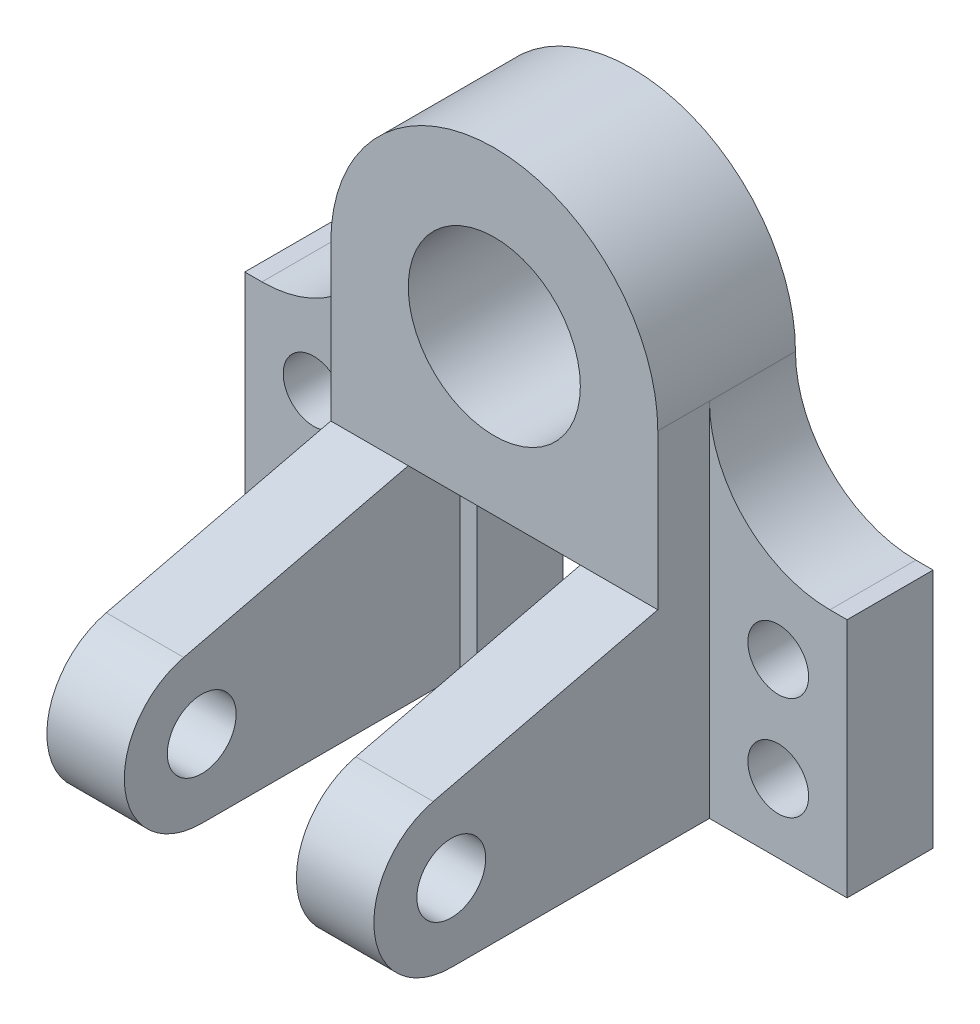
ISO-10303-21;
HEADER;
FILE_DESCRIPTION(('STEP AP214'),'2;1');
FILE_NAME('part.step','',(''),(''),'','','');
FILE_SCHEMA(('AUTOMOTIVE_DESIGN { 1 0 10303 214 1 1 1 1 }'));
ENDSEC;
DATA;
#1=APPLICATION_CONTEXT('core data for automotive mechanical design processes');
#2=APPLICATION_PROTOCOL_DEFINITION('international standard','automotive_design',2000,#1);
#3=PRODUCT_CONTEXT('',#1,'mechanical');
#4=PRODUCT('Part','Part','',(#3));
#5=PRODUCT_RELATED_PRODUCT_CATEGORY('part','',(#4));
#6=PRODUCT_DEFINITION_FORMATION('','',#4);
#7=PRODUCT_DEFINITION_CONTEXT('part definition',#1,'design');
#8=PRODUCT_DEFINITION('design','',#6,#7);
#9=PRODUCT_DEFINITION_SHAPE('','',#8);
#10=(LENGTH_UNIT() NAMED_UNIT(*) SI_UNIT(.MILLI.,.METRE.));
#11=(NAMED_UNIT(*) PLANE_ANGLE_UNIT() SI_UNIT($,.RADIAN.));
#12=(NAMED_UNIT(*) SI_UNIT($,.STERADIAN.) SOLID_ANGLE_UNIT());
#13=UNCERTAINTY_MEASURE_WITH_UNIT(LENGTH_MEASURE(1.E-05),#10,'distance_accuracy_value','');
#14=(GEOMETRIC_REPRESENTATION_CONTEXT(3) GLOBAL_UNCERTAINTY_ASSIGNED_CONTEXT((#13)) GLOBAL_UNIT_ASSIGNED_CONTEXT((#10,
#11,#12)) REPRESENTATION_CONTEXT('',''));
#15=CARTESIAN_POINT('',(0.,0.,0.));
#16=DIRECTION('',(0.,0.,1.));
#17=DIRECTION('',(1.,0.,0.));
#18=AXIS2_PLACEMENT_3D('',#15,#16,#17);
#19=CARTESIAN_POINT('',(1080.,480.,320.));
#20=DIRECTION('',(0.,1.,0.));
#21=DIRECTION('',(-1.,0.,0.));
#22=AXIS2_PLACEMENT_3D('',#19,#20,#21);
#23=PLANE('',#22);
#24=DIRECTION('',(0.,0.,-1.));
#25=VECTOR('',#24,1.);
#26=CARTESIAN_POINT('',(500.,480.,320.));
#27=LINE('',#26,#25);
#28=CARTESIAN_POINT('',(500.,480.,320.));
#29=VERTEX_POINT('',#28);
#30=CARTESIAN_POINT('',(500.,480.,200.));
#31=VERTEX_POINT('',#30);
#32=EDGE_CURVE('E187',#29,#31,#27,.T.);
#33=ORIENTED_EDGE('',*,*,#32,.T.);
#34=DIRECTION('',(-1.,0.,0.));
#35=VECTOR('',#34,1.);
#36=CARTESIAN_POINT('',(320.,480.,200.));
#37=LINE('',#36,#35);
#38=CARTESIAN_POINT('',(540.,480.,200.));
#39=VERTEX_POINT('',#38);
#40=EDGE_CURVE('E197',#39,#31,#37,.T.);
#41=ORIENTED_EDGE('',*,*,#40,.F.);
#42=DIRECTION('',(0.,0.,-1.));
#43=VECTOR('',#42,1.);
#44=CARTESIAN_POINT('',(540.,480.,200.));
#45=LINE('',#44,#43);
#46=CARTESIAN_POINT('',(540.,480.,0.));
#47=VERTEX_POINT('',#46);
#48=EDGE_CURVE('E237',#39,#47,#45,.T.);
#49=ORIENTED_EDGE('',*,*,#48,.T.);
#50=DIRECTION('',(1.,0.,0.));
#51=VECTOR('',#50,1.);
#52=CARTESIAN_POINT('',(1080.,480.,0.));
#53=LINE('',#52,#51);
#54=CARTESIAN_POINT('',(860.,480.,0.));
#55=VERTEX_POINT('',#54);
#56=EDGE_CURVE('E280',#47,#55,#53,.T.);
#57=ORIENTED_EDGE('',*,*,#56,.T.);
#58=DIRECTION('',(0.,0.,-1.));
#59=VECTOR('',#58,1.);
#60=CARTESIAN_POINT('',(860.,480.,200.));
#61=LINE('',#60,#59);
#62=CARTESIAN_POINT('',(860.,480.,200.));
#63=VERTEX_POINT('',#62);
#64=EDGE_CURVE('E316',#63,#55,#61,.T.);
#65=ORIENTED_EDGE('',*,*,#64,.F.);
#66=DIRECTION('',(-1.,0.,0.));
#67=VECTOR('',#66,1.);
#68=CARTESIAN_POINT('',(1080.,480.,200.));
#69=LINE('',#68,#67);
#70=CARTESIAN_POINT('',(900.,480.,200.));
#71=VERTEX_POINT('',#70);
#72=EDGE_CURVE('E324',#71,#63,#69,.T.);
#73=ORIENTED_EDGE('',*,*,#72,.F.);
#74=DIRECTION('',(0.,0.,1.));
#75=VECTOR('',#74,1.);
#76=CARTESIAN_POINT('',(900.,480.,320.));
#77=LINE('',#76,#75);
#78=CARTESIAN_POINT('',(900.,480.,320.));
#79=VERTEX_POINT('',#78);
#80=EDGE_CURVE('E384',#71,#79,#77,.T.);
#81=ORIENTED_EDGE('',*,*,#80,.T.);
#82=DIRECTION('',(1.,0.,0.));
#83=VECTOR('',#82,1.);
#84=CARTESIAN_POINT('',(540.,480.,320.));
#85=LINE('',#84,#83);
#86=EDGE_CURVE('E200',#29,#79,#85,.T.);
#87=ORIENTED_EDGE('',*,*,#86,.F.);
#88=EDGE_LOOP('',(#33,#41,#49,#57,#65,#73,#81,#87));
#89=FACE_BOUND('',#88,.T.);
#90=ADVANCED_FACE('F33',(#89),#23,.F.);
#91=CARTESIAN_POINT('',(0.,0.,200.));
#92=DIRECTION('',(0.,0.,-1.));
#93=DIRECTION('',(-1.,0.,0.));
#94=AXIS2_PLACEMENT_3D('',#91,#92,#93);
#95=PLANE('',#94);
#96=DIRECTION('',(0.,-1.,0.));
#97=VECTOR('',#96,1.);
#98=CARTESIAN_POINT('',(500.,480.,200.));
#99=LINE('',#98,#97);
#100=CARTESIAN_POINT('',(500.,0.,200.));
#101=VERTEX_POINT('',#100);
#102=EDGE_CURVE('E183',#31,#101,#99,.T.);
#103=ORIENTED_EDGE('',*,*,#102,.T.);
#104=DIRECTION('',(1.,0.,0.));
#105=VECTOR('',#104,1.);
#106=CARTESIAN_POINT('',(540.,0.,200.));
#107=LINE('',#106,#105);
#108=CARTESIAN_POINT('',(540.,0.,200.));
#109=VERTEX_POINT('',#108);
#110=EDGE_CURVE('E231',#101,#109,#107,.T.);
#111=ORIENTED_EDGE('',*,*,#110,.T.);
#112=DIRECTION('',(0.,1.,0.));
#113=VECTOR('',#112,1.);
#114=CARTESIAN_POINT('',(540.,480.,200.));
#115=LINE('',#114,#113);
#116=EDGE_CURVE('E206',#109,#39,#115,.T.);
#117=ORIENTED_EDGE('',*,*,#116,.T.);
#118=ORIENTED_EDGE('',*,*,#40,.T.);
#119=EDGE_LOOP('',(#103,#111,#117,#118));
#120=FACE_BOUND('',#119,.T.);
#121=ADVANCED_FACE('F204',(#120),#95,.F.);
#122=CARTESIAN_POINT('',(0.,0.,200.));
#123=DIRECTION('',(0.,0.,1.));
#124=DIRECTION('',(1.,0.,0.));
#125=AXIS2_PLACEMENT_3D('',#122,#123,#124);
#126=PLANE('',#125);
#127=DIRECTION('',(1.,0.,0.));
#128=VECTOR('',#127,1.);
#129=CARTESIAN_POINT('',(860.,0.,200.));
#130=LINE('',#129,#128);
#131=CARTESIAN_POINT('',(860.,0.,200.));
#132=VERTEX_POINT('',#131);
#133=CARTESIAN_POINT('',(900.,0.,200.));
#134=VERTEX_POINT('',#133);
#135=EDGE_CURVE('E423',#132,#134,#130,.T.);
#136=ORIENTED_EDGE('',*,*,#135,.T.);
#137=DIRECTION('',(0.,1.,0.));
#138=VECTOR('',#137,1.);
#139=CARTESIAN_POINT('',(900.,1.71450551880629E-13,200.));
#140=LINE('',#139,#138);
#141=EDGE_CURVE('E382',#134,#71,#140,.T.);
#142=ORIENTED_EDGE('',*,*,#141,.T.);
#143=ORIENTED_EDGE('',*,*,#72,.T.);
#144=DIRECTION('',(0.,-1.,0.));
#145=VECTOR('',#144,1.);
#146=CARTESIAN_POINT('',(860.,480.,200.));
#147=LINE('',#146,#145);
#148=EDGE_CURVE('E322',#63,#132,#147,.T.);
#149=ORIENTED_EDGE('',*,*,#148,.T.);
#150=EDGE_LOOP('',(#136,#142,#143,#149));
#151=FACE_BOUND('',#150,.T.);
#152=ADVANCED_FACE('F470',(#151),#126,.T.);
#153=CARTESIAN_POINT('',(0.,0.,200.));
#154=VERTEX_POINT('',#153);
#155=CARTESIAN_POINT('',(320.,0.,200.));
#156=VERTEX_POINT('',#155);
#157=EDGE_CURVE('E212',#154,#156,#107,.T.);
#158=ORIENTED_EDGE('',*,*,#157,.T.);
#159=DIRECTION('',(0.,1.,0.));
#160=VECTOR('',#159,1.);
#161=CARTESIAN_POINT('',(320.,560.,200.));
#162=LINE('',#161,#160);
#163=CARTESIAN_POINT('',(320.,840.,200.));
#164=VERTEX_POINT('',#163);
#165=EDGE_CURVE('E208',#156,#164,#162,.T.);
#166=ORIENTED_EDGE('',*,*,#165,.T.);
#167=CARTESIAN_POINT('',(40.,840.,200.));
#168=DIRECTION('',(0.,0.,-1.));
#169=DIRECTION('',(-1.,0.,0.));
#170=AXIS2_PLACEMENT_3D('',#167,#168,#169);
#171=CIRCLE('',#170,280.);
#172=CARTESIAN_POINT('',(40.,560.,200.));
#173=VERTEX_POINT('',#172);
#174=EDGE_CURVE('E247',#164,#173,#171,.T.);
#175=ORIENTED_EDGE('',*,*,#174,.T.);
#176=DIRECTION('',(-1.,0.,0.));
#177=VECTOR('',#176,1.);
#178=CARTESIAN_POINT('',(0.,560.,200.));
#179=LINE('',#178,#177);
#180=CARTESIAN_POINT('',(0.,560.,200.));
#181=VERTEX_POINT('',#180);
#182=EDGE_CURVE('E210',#173,#181,#179,.T.);
#183=ORIENTED_EDGE('',*,*,#182,.T.);
#184=DIRECTION('',(0.,-1.,0.));
#185=VECTOR('',#184,1.);
#186=CARTESIAN_POINT('',(0.,0.,200.));
#187=LINE('',#186,#185);
#188=EDGE_CURVE('E217',#181,#154,#187,.T.);
#189=ORIENTED_EDGE('',*,*,#188,.T.);
#190=EDGE_LOOP('',(#158,#166,#175,#183,#189));
#191=FACE_BOUND('',#190,.T.);
#192=CARTESIAN_POINT('',(160.,400.,200.));
#193=DIRECTION('',(0.,0.,1.));
#194=DIRECTION('',(1.,0.,0.));
#195=AXIS2_PLACEMENT_3D('',#192,#193,#194);
#196=CIRCLE('',#195,70.5953616406225);
#197=CARTESIAN_POINT('',(230.595361640622,400.,200.));
#198=VERTEX_POINT('',#197);
#199=EDGE_CURVE('E224',#198,#198,#196,.T.);
#200=ORIENTED_EDGE('',*,*,#199,.F.);
#201=EDGE_LOOP('',(#200));
#202=FACE_BOUND('',#201,.T.);
#203=CARTESIAN_POINT('',(160.,160.,200.));
#204=DIRECTION('',(0.,0.,1.));
#205=DIRECTION('',(1.,0.,0.));
#206=AXIS2_PLACEMENT_3D('',#203,#204,#205);
#207=CIRCLE('',#206,70.5953616406225);
#208=CARTESIAN_POINT('',(230.595361640622,160.,200.));
#209=VERTEX_POINT('',#208);
#210=EDGE_CURVE('E293',#209,#209,#207,.T.);
#211=ORIENTED_EDGE('',*,*,#210,.F.);
#212=EDGE_LOOP('',(#211));
#213=FACE_BOUND('',#212,.T.);
#214=ADVANCED_FACE('F253',(#191,#202,#213),#95,.F.);
#215=CARTESIAN_POINT('',(0.,0.,0.));
#216=DIRECTION('',(0.,0.,-1.));
#217=DIRECTION('',(-1.,0.,0.));
#218=AXIS2_PLACEMENT_3D('',#215,#216,#217);
#219=PLANE('',#218);
#220=DIRECTION('',(0.,-1.,0.));
#221=VECTOR('',#220,1.);
#222=CARTESIAN_POINT('',(860.,480.,0.));
#223=LINE('',#222,#221);
#224=CARTESIAN_POINT('',(860.,0.,0.));
#225=VERTEX_POINT('',#224);
#226=EDGE_CURVE('E312',#55,#225,#223,.T.);
#227=ORIENTED_EDGE('',*,*,#226,.F.);
#228=ORIENTED_EDGE('',*,*,#56,.F.);
#229=DIRECTION('',(0.,1.,0.));
#230=VECTOR('',#229,1.);
#231=CARTESIAN_POINT('',(540.,480.,0.));
#232=LINE('',#231,#230);
#233=CARTESIAN_POINT('',(540.,0.,0.));
#234=VERTEX_POINT('',#233);
#235=EDGE_CURVE('E223',#234,#47,#232,.T.);
#236=ORIENTED_EDGE('',*,*,#235,.F.);
#237=DIRECTION('',(1.,0.,0.));
#238=VECTOR('',#237,1.);
#239=CARTESIAN_POINT('',(540.,0.,0.));
#240=LINE('',#239,#238);
#241=CARTESIAN_POINT('',(0.,0.,0.));
#242=VERTEX_POINT('',#241);
#243=EDGE_CURVE('E220',#242,#234,#240,.T.);
#244=ORIENTED_EDGE('',*,*,#243,.F.);
#245=DIRECTION('',(0.,-1.,0.));
#246=VECTOR('',#245,1.);
#247=CARTESIAN_POINT('',(0.,0.,0.));
#248=LINE('',#247,#246);
#249=CARTESIAN_POINT('',(0.,560.,0.));
#250=VERTEX_POINT('',#249);
#251=EDGE_CURVE('E229',#250,#242,#248,.T.);
#252=ORIENTED_EDGE('',*,*,#251,.F.);
#253=DIRECTION('',(-1.,0.,0.));
#254=VECTOR('',#253,1.);
#255=CARTESIAN_POINT('',(0.,560.,0.));
#256=LINE('',#255,#254);
#257=CARTESIAN_POINT('',(40.,560.,0.));
#258=VERTEX_POINT('',#257);
#259=EDGE_CURVE('E227',#258,#250,#256,.T.);
#260=ORIENTED_EDGE('',*,*,#259,.F.);
#261=CARTESIAN_POINT('',(40.,840.,0.));
#262=DIRECTION('',(0.,0.,-1.));
#263=DIRECTION('',(-1.,0.,0.));
#264=AXIS2_PLACEMENT_3D('',#261,#262,#263);
#265=CIRCLE('',#264,280.);
#266=CARTESIAN_POINT('',(320.,840.,0.));
#267=VERTEX_POINT('',#266);
#268=EDGE_CURVE('E245',#258,#267,#265,.F.);
#269=ORIENTED_EDGE('',*,*,#268,.T.);
#270=CARTESIAN_POINT('',(700.,840.,0.));
#271=DIRECTION('',(0.,0.,1.));
#272=DIRECTION('',(1.,0.,0.));
#273=AXIS2_PLACEMENT_3D('',#270,#271,#272);
#274=CIRCLE('',#273,380.);
#275=CARTESIAN_POINT('',(1080.,840.,0.));
#276=VERTEX_POINT('',#275);
#277=EDGE_CURVE('E270',#276,#267,#274,.T.);
#278=ORIENTED_EDGE('',*,*,#277,.F.);
#279=CARTESIAN_POINT('',(1360.,840.,0.));
#280=DIRECTION('',(0.,0.,-1.));
#281=DIRECTION('',(-1.,0.,0.));
#282=AXIS2_PLACEMENT_3D('',#279,#280,#281);
#283=CIRCLE('',#282,280.);
#284=CARTESIAN_POINT('',(1360.,560.,0.));
#285=VERTEX_POINT('',#284);
#286=EDGE_CURVE('E41',#276,#285,#283,.F.);
#287=ORIENTED_EDGE('',*,*,#286,.T.);
#288=DIRECTION('',(-1.,0.,0.));
#289=VECTOR('',#288,1.);
#290=CARTESIAN_POINT('',(1400.,560.,0.));
#291=LINE('',#290,#289);
#292=CARTESIAN_POINT('',(1400.,560.,0.));
#293=VERTEX_POINT('',#292);
#294=EDGE_CURVE('E332',#293,#285,#291,.T.);
#295=ORIENTED_EDGE('',*,*,#294,.F.);
#296=DIRECTION('',(0.,1.,0.));
#297=VECTOR('',#296,1.);
#298=CARTESIAN_POINT('',(1400.,1.71450551880629E-13,0.));
#299=LINE('',#298,#297);
#300=CARTESIAN_POINT('',(1400.,1.71450551880629E-13,0.));
#301=VERTEX_POINT('',#300);
#302=EDGE_CURVE('E432',#301,#293,#299,.T.);
#303=ORIENTED_EDGE('',*,*,#302,.F.);
#304=DIRECTION('',(1.,0.,0.));
#305=VECTOR('',#304,1.);
#306=CARTESIAN_POINT('',(860.,0.,0.));
#307=LINE('',#306,#305);
#308=EDGE_CURVE('E431',#225,#301,#307,.T.);
#309=ORIENTED_EDGE('',*,*,#308,.F.);
#310=EDGE_LOOP('',(#227,#228,#236,#244,#252,#260,#269,#278,#287,#295,#303,#309));
#311=FACE_BOUND('',#310,.T.);
#312=CARTESIAN_POINT('',(160.,400.,0.));
#313=DIRECTION('',(0.,0.,1.));
#314=DIRECTION('',(1.,0.,0.));
#315=AXIS2_PLACEMENT_3D('',#312,#313,#314);
#316=CIRCLE('',#315,70.5953616406225);
#317=CARTESIAN_POINT('',(230.595361640622,400.,0.));
#318=VERTEX_POINT('',#317);
#319=EDGE_CURVE('E296',#318,#318,#316,.T.);
#320=ORIENTED_EDGE('',*,*,#319,.T.);
#321=EDGE_LOOP('',(#320));
#322=FACE_BOUND('',#321,.T.);
#323=CARTESIAN_POINT('',(160.,160.,0.));
#324=DIRECTION('',(0.,0.,1.));
#325=DIRECTION('',(1.,0.,0.));
#326=AXIS2_PLACEMENT_3D('',#323,#324,#325);
#327=CIRCLE('',#326,70.5953616406225);
#328=CARTESIAN_POINT('',(230.595361640622,160.,0.));
#329=VERTEX_POINT('',#328);
#330=EDGE_CURVE('E292',#329,#329,#327,.T.);
#331=ORIENTED_EDGE('',*,*,#330,.T.);
#332=EDGE_LOOP('',(#331));
#333=FACE_BOUND('',#332,.T.);
#334=CARTESIAN_POINT('',(700.,840.,0.));
#335=DIRECTION('',(0.,0.,1.));
#336=DIRECTION('',(1.,0.,0.));
#337=AXIS2_PLACEMENT_3D('',#334,#335,#336);
#338=CIRCLE('',#337,200.);
#339=CARTESIAN_POINT('',(900.,840.,0.));
#340=VERTEX_POINT('',#339);
#341=EDGE_CURVE('E340',#340,#340,#338,.T.);
#342=ORIENTED_EDGE('',*,*,#341,.T.);
#343=EDGE_LOOP('',(#342));
#344=FACE_BOUND('',#343,.T.);
#345=CARTESIAN_POINT('',(1240.,160.,0.));
#346=DIRECTION('',(0.,0.,1.));
#347=DIRECTION('',(-1.,0.,0.));
#348=AXIS2_PLACEMENT_3D('',#345,#346,#347);
#349=CIRCLE('',#348,70.5953616406224);
#350=CARTESIAN_POINT('',(1169.40463835938,160.,0.));
#351=VERTEX_POINT('',#350);
#352=EDGE_CURVE('E413',#351,#351,#349,.T.);
#353=ORIENTED_EDGE('',*,*,#352,.T.);
#354=EDGE_LOOP('',(#353));
#355=FACE_BOUND('',#354,.T.);
#356=CARTESIAN_POINT('',(1240.,400.,0.));
#357=DIRECTION('',(0.,0.,1.));
#358=DIRECTION('',(-1.,0.,0.));
#359=AXIS2_PLACEMENT_3D('',#356,#357,#358);
#360=CIRCLE('',#359,70.5953616406221);
#361=CARTESIAN_POINT('',(1169.40463835938,400.,0.));
#362=VERTEX_POINT('',#361);
#363=EDGE_CURVE('E406',#362,#362,#360,.T.);
#364=ORIENTED_EDGE('',*,*,#363,.T.);
#365=EDGE_LOOP('',(#364));
#366=FACE_BOUND('',#365,.T.);
#367=ADVANCED_FACE('F268',(#311,#322,#333,#344,#355,#366),#219,.T.);
#368=CARTESIAN_POINT('',(540.,0.,200.));
#369=DIRECTION('',(0.,1.,0.));
#370=DIRECTION('',(-1.,0.,0.));
#371=AXIS2_PLACEMENT_3D('',#368,#369,#370);
#372=PLANE('',#371);
#373=ORIENTED_EDGE('',*,*,#243,.T.);
#374=DIRECTION('',(0.,0.,-1.));
#375=VECTOR('',#374,1.);
#376=CARTESIAN_POINT('',(540.,0.,200.));
#377=LINE('',#376,#375);
#378=EDGE_CURVE('E239',#109,#234,#377,.T.);
#379=ORIENTED_EDGE('',*,*,#378,.F.);
#380=ORIENTED_EDGE('',*,*,#110,.F.);
#381=DIRECTION('',(0.,0.,1.));
#382=VECTOR('',#381,1.);
#383=CARTESIAN_POINT('',(500.,0.,200.));
#384=LINE('',#383,#382);
#385=CARTESIAN_POINT('',(500.,0.,800.));
#386=VERTEX_POINT('',#385);
#387=EDGE_CURVE('E191',#101,#386,#384,.T.);
#388=ORIENTED_EDGE('',*,*,#387,.T.);
#389=DIRECTION('',(-1.,0.,0.));
#390=VECTOR('',#389,1.);
#391=CARTESIAN_POINT('',(500.,0.,800.));
#392=LINE('',#391,#390);
#393=CARTESIAN_POINT('',(320.,0.,800.));
#394=VERTEX_POINT('',#393);
#395=EDGE_CURVE('E373',#386,#394,#392,.T.);
#396=ORIENTED_EDGE('',*,*,#395,.T.);
#397=DIRECTION('',(0.,0.,1.));
#398=VECTOR('',#397,1.);
#399=CARTESIAN_POINT('',(320.,0.,200.));
#400=LINE('',#399,#398);
#401=EDGE_CURVE('E366',#156,#394,#400,.T.);
#402=ORIENTED_EDGE('',*,*,#401,.F.);
#403=ORIENTED_EDGE('',*,*,#157,.F.);
#404=DIRECTION('',(0.,0.,-1.));
#405=VECTOR('',#404,1.);
#406=CARTESIAN_POINT('',(0.,0.,200.));
#407=LINE('',#406,#405);
#408=EDGE_CURVE('E219',#154,#242,#407,.T.);
#409=ORIENTED_EDGE('',*,*,#408,.T.);
#410=EDGE_LOOP('',(#373,#379,#380,#388,#396,#402,#403,#409));
#411=FACE_BOUND('',#410,.T.);
#412=ADVANCED_FACE('F307',(#411),#372,.F.);
#413=CARTESIAN_POINT('',(540.,480.,200.));
#414=DIRECTION('',(-1.,0.,0.));
#415=DIRECTION('',(0.,-1.,0.));
#416=AXIS2_PLACEMENT_3D('',#413,#414,#415);
#417=PLANE('',#416);
#418=ORIENTED_EDGE('',*,*,#235,.T.);
#419=ORIENTED_EDGE('',*,*,#48,.F.);
#420=ORIENTED_EDGE('',*,*,#116,.F.);
#421=ORIENTED_EDGE('',*,*,#378,.T.);
#422=EDGE_LOOP('',(#418,#419,#420,#421));
#423=FACE_BOUND('',#422,.T.);
#424=ADVANCED_FACE('F306',(#423),#417,.F.);
#425=CARTESIAN_POINT('',(0.,560.,200.));
#426=DIRECTION('',(0.,-1.,0.));
#427=DIRECTION('',(0.,0.,-1.));
#428=AXIS2_PLACEMENT_3D('',#425,#426,#427);
#429=PLANE('',#428);
#430=ORIENTED_EDGE('',*,*,#182,.F.);
#431=DIRECTION('',(0.,0.,-1.));
#432=VECTOR('',#431,1.);
#433=CARTESIAN_POINT('',(40.,560.,0.));
#434=LINE('',#433,#432);
#435=EDGE_CURVE('E242',#173,#258,#434,.T.);
#436=ORIENTED_EDGE('',*,*,#435,.T.);
#437=ORIENTED_EDGE('',*,*,#259,.T.);
#438=DIRECTION('',(0.,0.,-1.));
#439=VECTOR('',#438,1.);
#440=CARTESIAN_POINT('',(0.,560.,200.));
#441=LINE('',#440,#439);
#442=EDGE_CURVE('E234',#181,#250,#441,.T.);
#443=ORIENTED_EDGE('',*,*,#442,.F.);
#444=EDGE_LOOP('',(#430,#436,#437,#443));
#445=FACE_BOUND('',#444,.T.);
#446=ADVANCED_FACE('F261',(#445),#429,.F.);
#447=CARTESIAN_POINT('',(0.,0.,200.));
#448=DIRECTION('',(1.,0.,0.));
#449=DIRECTION('',(0.,0.,-1.));
#450=AXIS2_PLACEMENT_3D('',#447,#448,#449);
#451=PLANE('',#450);
#452=ORIENTED_EDGE('',*,*,#251,.T.);
#453=ORIENTED_EDGE('',*,*,#408,.F.);
#454=ORIENTED_EDGE('',*,*,#188,.F.);
#455=ORIENTED_EDGE('',*,*,#442,.T.);
#456=EDGE_LOOP('',(#452,#453,#454,#455));
#457=FACE_BOUND('',#456,.T.);
#458=ADVANCED_FACE('F481',(#457),#451,.F.);
#459=CARTESIAN_POINT('',(160.,400.,200.));
#460=DIRECTION('',(0.,0.,-1.));
#461=DIRECTION('',(-1.,0.,0.));
#462=AXIS2_PLACEMENT_3D('',#459,#460,#461);
#463=CYLINDRICAL_SURFACE('',#462,70.5953616406225);
#464=ORIENTED_EDGE('',*,*,#199,.T.);
#465=EDGE_LOOP('',(#464));
#466=FACE_BOUND('',#465,.T.);
#467=ORIENTED_EDGE('',*,*,#319,.F.);
#468=EDGE_LOOP('',(#467));
#469=FACE_BOUND('',#468,.T.);
#470=ADVANCED_FACE('F478',(#466,#469),#463,.F.);
#471=CARTESIAN_POINT('',(160.,160.,200.));
#472=DIRECTION('',(0.,0.,-1.));
#473=DIRECTION('',(-1.,0.,0.));
#474=AXIS2_PLACEMENT_3D('',#471,#472,#473);
#475=CYLINDRICAL_SURFACE('',#474,70.5953616406225);
#476=ORIENTED_EDGE('',*,*,#210,.T.);
#477=EDGE_LOOP('',(#476));
#478=FACE_BOUND('',#477,.T.);
#479=ORIENTED_EDGE('',*,*,#330,.F.);
#480=EDGE_LOOP('',(#479));
#481=FACE_BOUND('',#480,.T.);
#482=ADVANCED_FACE('F475',(#478,#481),#475,.F.);
#483=CARTESIAN_POINT('',(320.,480.,320.));
#484=DIRECTION('',(1.,0.,0.));
#485=DIRECTION('',(0.,0.,-1.));
#486=AXIS2_PLACEMENT_3D('',#483,#484,#485);
#487=PLANE('',#486);
#488=DIRECTION('',(0.,0.,-1.));
#489=VECTOR('',#488,1.);
#490=CARTESIAN_POINT('',(320.,840.,320.));
#491=LINE('',#490,#489);
#492=CARTESIAN_POINT('',(320.,840.,320.));
#493=VERTEX_POINT('',#492);
#494=EDGE_CURVE('E288',#493,#164,#491,.T.);
#495=ORIENTED_EDGE('',*,*,#494,.T.);
#496=ORIENTED_EDGE('',*,*,#165,.F.);
#497=ORIENTED_EDGE('',*,*,#401,.T.);
#498=CARTESIAN_POINT('',(320.,180.,800.));
#499=DIRECTION('',(-1.,0.,0.));
#500=DIRECTION('',(0.,0.,1.));
#501=AXIS2_PLACEMENT_3D('',#498,#499,#500);
#502=CIRCLE('',#501,180.);
#503=CARTESIAN_POINT('',(320.,355.053388206728,841.908367629205));
#504=VERTEX_POINT('',#503);
#505=EDGE_CURVE('E363',#394,#504,#502,.T.);
#506=ORIENTED_EDGE('',*,*,#505,.T.);
#507=DIRECTION('',(0.,0.232824264606694,-0.972518823370711));
#508=VECTOR('',#507,1.);
#509=CARTESIAN_POINT('',(320.,355.053388206728,841.908367629205));
#510=LINE('',#509,#508);
#511=CARTESIAN_POINT('',(320.,480.,320.));
#512=VERTEX_POINT('',#511);
#513=EDGE_CURVE('E202',#504,#512,#510,.T.);
#514=ORIENTED_EDGE('',*,*,#513,.T.);
#515=DIRECTION('',(0.,-1.,0.));
#516=VECTOR('',#515,1.);
#517=CARTESIAN_POINT('',(320.,840.,320.));
#518=LINE('',#517,#516);
#519=EDGE_CURVE('E348',#493,#512,#518,.T.);
#520=ORIENTED_EDGE('',*,*,#519,.F.);
#521=EDGE_LOOP('',(#495,#496,#497,#506,#514,#520));
#522=FACE_BOUND('',#521,.T.);
#523=CARTESIAN_POINT('',(320.,180.,800.));
#524=DIRECTION('',(-1.,0.,0.));
#525=DIRECTION('',(0.,0.,1.));
#526=AXIS2_PLACEMENT_3D('',#523,#524,#525);
#527=CIRCLE('',#526,79.9999999999999);
#528=CARTESIAN_POINT('',(320.,180.,880.));
#529=VERTEX_POINT('',#528);
#530=EDGE_CURVE('E803',#529,#529,#527,.T.);
#531=ORIENTED_EDGE('',*,*,#530,.F.);
#532=EDGE_LOOP('',(#531));
#533=FACE_BOUND('',#532,.T.);
#534=ADVANCED_FACE('F357',(#522,#533),#487,.F.);
#535=CARTESIAN_POINT('',(700.,840.,320.));
#536=DIRECTION('',(0.,0.,1.));
#537=DIRECTION('',(1.,0.,0.));
#538=AXIS2_PLACEMENT_3D('',#535,#536,#537);
#539=PLANE('',#538);
#540=EDGE_CURVE('E282',#512,#29,#85,.T.);
#541=ORIENTED_EDGE('',*,*,#540,.T.);
#542=ORIENTED_EDGE('',*,*,#86,.T.);
#543=DIRECTION('',(1.,0.,0.));
#544=VECTOR('',#543,1.);
#545=CARTESIAN_POINT('',(900.,480.,320.));
#546=LINE('',#545,#544);
#547=CARTESIAN_POINT('',(1080.,480.,320.));
#548=VERTEX_POINT('',#547);
#549=EDGE_CURVE('E396',#79,#548,#546,.T.);
#550=ORIENTED_EDGE('',*,*,#549,.T.);
#551=DIRECTION('',(0.,1.,0.));
#552=VECTOR('',#551,1.);
#553=CARTESIAN_POINT('',(1080.,560.,320.));
#554=LINE('',#553,#552);
#555=CARTESIAN_POINT('',(1080.,840.,320.));
#556=VERTEX_POINT('',#555);
#557=EDGE_CURVE('E345',#548,#556,#554,.T.);
#558=ORIENTED_EDGE('',*,*,#557,.T.);
#559=CARTESIAN_POINT('',(700.,840.,320.));
#560=DIRECTION('',(0.,0.,1.));
#561=DIRECTION('',(1.,0.,0.));
#562=AXIS2_PLACEMENT_3D('',#559,#560,#561);
#563=CIRCLE('',#562,380.);
#564=EDGE_CURVE('E347',#556,#493,#563,.T.);
#565=ORIENTED_EDGE('',*,*,#564,.T.);
#566=ORIENTED_EDGE('',*,*,#519,.T.);
#567=EDGE_LOOP('',(#541,#542,#550,#558,#565,#566));
#568=FACE_BOUND('',#567,.T.);
#569=CARTESIAN_POINT('',(700.,840.,320.));
#570=DIRECTION('',(0.,0.,1.));
#571=DIRECTION('',(1.,0.,0.));
#572=AXIS2_PLACEMENT_3D('',#569,#570,#571);
#573=CIRCLE('',#572,200.);
#574=CARTESIAN_POINT('',(900.,840.,320.));
#575=VERTEX_POINT('',#574);
#576=EDGE_CURVE('E284',#575,#575,#573,.T.);
#577=ORIENTED_EDGE('',*,*,#576,.F.);
#578=EDGE_LOOP('',(#577));
#579=FACE_BOUND('',#578,.T.);
#580=ADVANCED_FACE('F352',(#568,#579),#539,.T.);
#581=CARTESIAN_POINT('',(1080.,560.,320.));
#582=DIRECTION('',(-1.,0.,0.));
#583=DIRECTION('',(0.,0.,1.));
#584=AXIS2_PLACEMENT_3D('',#581,#582,#583);
#585=PLANE('',#584);
#586=DIRECTION('',(0.,-1.,0.));
#587=VECTOR('',#586,1.);
#588=CARTESIAN_POINT('',(1080.,560.,200.));
#589=LINE('',#588,#587);
#590=CARTESIAN_POINT('',(1080.,840.,200.));
#591=VERTEX_POINT('',#590);
#592=CARTESIAN_POINT('',(1080.,1.71450551880629E-13,200.));
#593=VERTEX_POINT('',#592);
#594=EDGE_CURVE('E329',#591,#593,#589,.T.);
#595=ORIENTED_EDGE('',*,*,#594,.F.);
#596=DIRECTION('',(0.,0.,-1.));
#597=VECTOR('',#596,1.);
#598=CARTESIAN_POINT('',(1080.,840.,320.));
#599=LINE('',#598,#597);
#600=EDGE_CURVE('E290',#556,#591,#599,.T.);
#601=ORIENTED_EDGE('',*,*,#600,.F.);
#602=ORIENTED_EDGE('',*,*,#557,.F.);
#603=DIRECTION('',(0.,-0.232824264606694,0.972518823370711));
#604=VECTOR('',#603,1.);
#605=CARTESIAN_POINT('',(1080.,355.053388206728,841.908367629205));
#606=LINE('',#605,#604);
#607=CARTESIAN_POINT('',(1080.,355.053388206728,841.908367629205));
#608=VERTEX_POINT('',#607);
#609=EDGE_CURVE('E379',#548,#608,#606,.T.);
#610=ORIENTED_EDGE('',*,*,#609,.T.);
#611=CARTESIAN_POINT('',(1080.,180.,800.));
#612=DIRECTION('',(1.,0.,0.));
#613=DIRECTION('',(0.,0.,-1.));
#614=AXIS2_PLACEMENT_3D('',#611,#612,#613);
#615=CIRCLE('',#614,180.);
#616=CARTESIAN_POINT('',(1080.,0.,800.));
#617=VERTEX_POINT('',#616);
#618=EDGE_CURVE('E399',#608,#617,#615,.T.);
#619=ORIENTED_EDGE('',*,*,#618,.T.);
#620=DIRECTION('',(0.,0.,-1.));
#621=VECTOR('',#620,1.);
#622=CARTESIAN_POINT('',(1080.,1.71450551880629E-13,200.));
#623=LINE('',#622,#621);
#624=EDGE_CURVE('E385',#617,#593,#623,.T.);
#625=ORIENTED_EDGE('',*,*,#624,.T.);
#626=EDGE_LOOP('',(#595,#601,#602,#610,#619,#625));
#627=FACE_BOUND('',#626,.T.);
#628=CARTESIAN_POINT('',(1080.,180.,800.));
#629=DIRECTION('',(1.,0.,0.));
#630=DIRECTION('',(0.,0.,-1.));
#631=AXIS2_PLACEMENT_3D('',#628,#629,#630);
#632=CIRCLE('',#631,79.9999999999999);
#633=CARTESIAN_POINT('',(1080.,180.,720.));
#634=VERTEX_POINT('',#633);
#635=EDGE_CURVE('E372',#634,#634,#632,.T.);
#636=ORIENTED_EDGE('',*,*,#635,.F.);
#637=EDGE_LOOP('',(#636));
#638=FACE_BOUND('',#637,.T.);
#639=ADVANCED_FACE('F446',(#627,#638),#585,.F.);
#640=CARTESIAN_POINT('',(700.,840.,320.));
#641=DIRECTION('',(0.,0.,-1.));
#642=DIRECTION('',(-1.,0.,0.));
#643=AXIS2_PLACEMENT_3D('',#640,#641,#642);
#644=CYLINDRICAL_SURFACE('',#643,380.);
#645=ORIENTED_EDGE('',*,*,#277,.T.);
#646=EDGE_CURVE('E265',#164,#267,#491,.T.);
#647=ORIENTED_EDGE('',*,*,#646,.F.);
#648=ORIENTED_EDGE('',*,*,#494,.F.);
#649=ORIENTED_EDGE('',*,*,#564,.F.);
#650=ORIENTED_EDGE('',*,*,#600,.T.);
#651=EDGE_CURVE('E279',#591,#276,#599,.T.);
#652=ORIENTED_EDGE('',*,*,#651,.T.);
#653=EDGE_LOOP('',(#645,#647,#648,#649,#650,#652));
#654=FACE_BOUND('',#653,.T.);
#655=ADVANCED_FACE('F274',(#654),#644,.T.);
#656=CARTESIAN_POINT('',(700.,840.,320.));
#657=DIRECTION('',(0.,0.,-1.));
#658=DIRECTION('',(-1.,0.,0.));
#659=AXIS2_PLACEMENT_3D('',#656,#657,#658);
#660=CYLINDRICAL_SURFACE('',#659,200.);
#661=ORIENTED_EDGE('',*,*,#576,.T.);
#662=EDGE_LOOP('',(#661));
#663=FACE_BOUND('',#662,.T.);
#664=ORIENTED_EDGE('',*,*,#341,.F.);
#665=EDGE_LOOP('',(#664));
#666=FACE_BOUND('',#665,.T.);
#667=ADVANCED_FACE('F542',(#663,#666),#660,.F.);
#668=ORIENTED_EDGE('',*,*,#594,.T.);
#669=CARTESIAN_POINT('',(1400.,1.71450551880629E-13,200.));
#670=VERTEX_POINT('',#669);
#671=EDGE_CURVE('E422',#593,#670,#130,.T.);
#672=ORIENTED_EDGE('',*,*,#671,.T.);
#673=DIRECTION('',(0.,1.,0.));
#674=VECTOR('',#673,1.);
#675=CARTESIAN_POINT('',(1400.,1.71450551880629E-13,200.));
#676=LINE('',#675,#674);
#677=CARTESIAN_POINT('',(1400.,560.,200.));
#678=VERTEX_POINT('',#677);
#679=EDGE_CURVE('E425',#670,#678,#676,.T.);
#680=ORIENTED_EDGE('',*,*,#679,.T.);
#681=DIRECTION('',(-1.,0.,0.));
#682=VECTOR('',#681,1.);
#683=CARTESIAN_POINT('',(1400.,560.,200.));
#684=LINE('',#683,#682);
#685=CARTESIAN_POINT('',(1360.,560.,200.));
#686=VERTEX_POINT('',#685);
#687=EDGE_CURVE('E427',#678,#686,#684,.T.);
#688=ORIENTED_EDGE('',*,*,#687,.T.);
#689=CARTESIAN_POINT('',(1360.,840.,200.));
#690=DIRECTION('',(0.,0.,1.));
#691=DIRECTION('',(1.,0.,0.));
#692=AXIS2_PLACEMENT_3D('',#689,#690,#691);
#693=CIRCLE('',#692,280.);
#694=EDGE_CURVE('E11',#686,#591,#693,.F.);
#695=ORIENTED_EDGE('',*,*,#694,.T.);
#696=EDGE_LOOP('',(#668,#672,#680,#688,#695));
#697=FACE_BOUND('',#696,.T.);
#698=CARTESIAN_POINT('',(1240.,160.,200.));
#699=DIRECTION('',(0.,0.,1.));
#700=DIRECTION('',(-1.,0.,0.));
#701=AXIS2_PLACEMENT_3D('',#698,#699,#700);
#702=CIRCLE('',#701,70.5953616406224);
#703=CARTESIAN_POINT('',(1169.40463835938,160.,200.));
#704=VERTEX_POINT('',#703);
#705=EDGE_CURVE('E416',#704,#704,#702,.T.);
#706=ORIENTED_EDGE('',*,*,#705,.F.);
#707=EDGE_LOOP('',(#706));
#708=FACE_BOUND('',#707,.T.);
#709=CARTESIAN_POINT('',(1240.,400.,200.));
#710=DIRECTION('',(0.,0.,1.));
#711=DIRECTION('',(-1.,0.,0.));
#712=AXIS2_PLACEMENT_3D('',#709,#710,#711);
#713=CIRCLE('',#712,70.5953616406221);
#714=CARTESIAN_POINT('',(1169.40463835938,400.,200.));
#715=VERTEX_POINT('',#714);
#716=EDGE_CURVE('E410',#715,#715,#713,.T.);
#717=ORIENTED_EDGE('',*,*,#716,.F.);
#718=EDGE_LOOP('',(#717));
#719=FACE_BOUND('',#718,.T.);
#720=ADVANCED_FACE('F440',(#697,#708,#719),#126,.T.);
#721=CARTESIAN_POINT('',(860.,480.,200.));
#722=DIRECTION('',(1.,0.,0.));
#723=DIRECTION('',(0.,1.,0.));
#724=AXIS2_PLACEMENT_3D('',#721,#722,#723);
#725=PLANE('',#724);
#726=ORIENTED_EDGE('',*,*,#226,.T.);
#727=DIRECTION('',(0.,0.,-1.));
#728=VECTOR('',#727,1.);
#729=CARTESIAN_POINT('',(860.,0.,200.));
#730=LINE('',#729,#728);
#731=EDGE_CURVE('E337',#132,#225,#730,.T.);
#732=ORIENTED_EDGE('',*,*,#731,.F.);
#733=ORIENTED_EDGE('',*,*,#148,.F.);
#734=ORIENTED_EDGE('',*,*,#64,.T.);
#735=EDGE_LOOP('',(#726,#732,#733,#734));
#736=FACE_BOUND('',#735,.T.);
#737=ADVANCED_FACE('F319',(#736),#725,.F.);
#738=CARTESIAN_POINT('',(860.,0.,200.));
#739=DIRECTION('',(0.,1.,0.));
#740=DIRECTION('',(-1.,0.,0.));
#741=AXIS2_PLACEMENT_3D('',#738,#739,#740);
#742=PLANE('',#741);
#743=ORIENTED_EDGE('',*,*,#308,.T.);
#744=DIRECTION('',(0.,0.,-1.));
#745=VECTOR('',#744,1.);
#746=CARTESIAN_POINT('',(1400.,1.71450551880629E-13,200.));
#747=LINE('',#746,#745);
#748=EDGE_CURVE('E327',#670,#301,#747,.T.);
#749=ORIENTED_EDGE('',*,*,#748,.F.);
#750=ORIENTED_EDGE('',*,*,#671,.F.);
#751=ORIENTED_EDGE('',*,*,#624,.F.);
#752=DIRECTION('',(1.,0.,0.));
#753=VECTOR('',#752,1.);
#754=CARTESIAN_POINT('',(900.,0.,800.));
#755=LINE('',#754,#753);
#756=CARTESIAN_POINT('',(900.,0.,800.));
#757=VERTEX_POINT('',#756);
#758=EDGE_CURVE('E404',#757,#617,#755,.T.);
#759=ORIENTED_EDGE('',*,*,#758,.F.);
#760=DIRECTION('',(0.,0.,-1.));
#761=VECTOR('',#760,1.);
#762=CARTESIAN_POINT('',(900.,1.71450551880629E-13,200.));
#763=LINE('',#762,#761);
#764=EDGE_CURVE('E393',#757,#134,#763,.T.);
#765=ORIENTED_EDGE('',*,*,#764,.T.);
#766=ORIENTED_EDGE('',*,*,#135,.F.);
#767=ORIENTED_EDGE('',*,*,#731,.T.);
#768=EDGE_LOOP('',(#743,#749,#750,#751,#759,#765,#766,#767));
#769=FACE_BOUND('',#768,.T.);
#770=ADVANCED_FACE('F452',(#769),#742,.F.);
#771=CARTESIAN_POINT('',(1400.,1.71450551880629E-13,200.));
#772=DIRECTION('',(-1.,0.,0.));
#773=DIRECTION('',(0.,0.,1.));
#774=AXIS2_PLACEMENT_3D('',#771,#772,#773);
#775=PLANE('',#774);
#776=ORIENTED_EDGE('',*,*,#302,.T.);
#777=DIRECTION('',(0.,0.,-1.));
#778=VECTOR('',#777,1.);
#779=CARTESIAN_POINT('',(1400.,560.,200.));
#780=LINE('',#779,#778);
#781=EDGE_CURVE('E323',#678,#293,#780,.T.);
#782=ORIENTED_EDGE('',*,*,#781,.F.);
#783=ORIENTED_EDGE('',*,*,#679,.F.);
#784=ORIENTED_EDGE('',*,*,#748,.T.);
#785=EDGE_LOOP('',(#776,#782,#783,#784));
#786=FACE_BOUND('',#785,.T.);
#787=ADVANCED_FACE('F455',(#786),#775,.F.);
#788=CARTESIAN_POINT('',(1400.,560.,200.));
#789=DIRECTION('',(0.,-1.,0.));
#790=DIRECTION('',(1.,0.,0.));
#791=AXIS2_PLACEMENT_3D('',#788,#789,#790);
#792=PLANE('',#791);
#793=ORIENTED_EDGE('',*,*,#294,.T.);
#794=DIRECTION('',(0.,0.,-1.));
#795=VECTOR('',#794,1.);
#796=CARTESIAN_POINT('',(1360.,560.,200.));
#797=LINE('',#796,#795);
#798=EDGE_CURVE('E48',#285,#686,#797,.F.);
#799=ORIENTED_EDGE('',*,*,#798,.T.);
#800=ORIENTED_EDGE('',*,*,#687,.F.);
#801=ORIENTED_EDGE('',*,*,#781,.T.);
#802=EDGE_LOOP('',(#793,#799,#800,#801));
#803=FACE_BOUND('',#802,.T.);
#804=ADVANCED_FACE('F436',(#803),#792,.F.);
#805=CARTESIAN_POINT('',(1240.,160.,200.));
#806=DIRECTION('',(0.,0.,-1.));
#807=DIRECTION('',(-1.,0.,0.));
#808=AXIS2_PLACEMENT_3D('',#805,#806,#807);
#809=CYLINDRICAL_SURFACE('',#808,70.5953616406224);
#810=ORIENTED_EDGE('',*,*,#705,.T.);
#811=EDGE_LOOP('',(#810));
#812=FACE_BOUND('',#811,.T.);
#813=ORIENTED_EDGE('',*,*,#352,.F.);
#814=EDGE_LOOP('',(#813));
#815=FACE_BOUND('',#814,.T.);
#816=ADVANCED_FACE('F462',(#812,#815),#809,.F.);
#817=CARTESIAN_POINT('',(1240.,400.,200.));
#818=DIRECTION('',(0.,0.,-1.));
#819=DIRECTION('',(-1.,0.,0.));
#820=AXIS2_PLACEMENT_3D('',#817,#818,#819);
#821=CYLINDRICAL_SURFACE('',#820,70.5953616406221);
#822=ORIENTED_EDGE('',*,*,#716,.T.);
#823=EDGE_LOOP('',(#822));
#824=FACE_BOUND('',#823,.T.);
#825=ORIENTED_EDGE('',*,*,#363,.F.);
#826=EDGE_LOOP('',(#825));
#827=FACE_BOUND('',#826,.T.);
#828=ADVANCED_FACE('F530',(#824,#827),#821,.F.);
#829=CARTESIAN_POINT('',(900.,180.,800.));
#830=DIRECTION('',(1.,0.,0.));
#831=DIRECTION('',(0.,0.,-1.));
#832=AXIS2_PLACEMENT_3D('',#829,#830,#831);
#833=CYLINDRICAL_SURFACE('',#832,180.);
#834=ORIENTED_EDGE('',*,*,#618,.F.);
#835=DIRECTION('',(1.,0.,0.));
#836=VECTOR('',#835,1.);
#837=CARTESIAN_POINT('',(900.,355.053388206728,841.908367629205));
#838=LINE('',#837,#836);
#839=CARTESIAN_POINT('',(900.,355.053388206728,841.908367629205));
#840=VERTEX_POINT('',#839);
#841=EDGE_CURVE('E407',#840,#608,#838,.T.);
#842=ORIENTED_EDGE('',*,*,#841,.F.);
#843=CARTESIAN_POINT('',(900.,180.,800.));
#844=DIRECTION('',(1.,0.,0.));
#845=DIRECTION('',(0.,0.,-1.));
#846=AXIS2_PLACEMENT_3D('',#843,#844,#845);
#847=CIRCLE('',#846,180.);
#848=EDGE_CURVE('E390',#840,#757,#847,.T.);
#849=ORIENTED_EDGE('',*,*,#848,.T.);
#850=ORIENTED_EDGE('',*,*,#758,.T.);
#851=EDGE_LOOP('',(#834,#842,#849,#850));
#852=FACE_BOUND('',#851,.T.);
#853=ADVANCED_FACE('F527',(#852),#833,.T.);
#854=CARTESIAN_POINT('',(900.,355.053388206728,841.908367629205));
#855=DIRECTION('',(0.,0.972518823370711,0.232824264606694));
#856=DIRECTION('',(0.,-0.232824264606694,0.972518823370711));
#857=AXIS2_PLACEMENT_3D('',#854,#855,#856);
#858=PLANE('',#857);
#859=ORIENTED_EDGE('',*,*,#609,.F.);
#860=ORIENTED_EDGE('',*,*,#549,.F.);
#861=DIRECTION('',(0.,-0.232824264606694,0.972518823370711));
#862=VECTOR('',#861,1.);
#863=CARTESIAN_POINT('',(900.,355.053388206728,841.908367629205));
#864=LINE('',#863,#862);
#865=EDGE_CURVE('E387',#79,#840,#864,.T.);
#866=ORIENTED_EDGE('',*,*,#865,.T.);
#867=ORIENTED_EDGE('',*,*,#841,.T.);
#868=EDGE_LOOP('',(#859,#860,#866,#867));
#869=FACE_BOUND('',#868,.T.);
#870=ADVANCED_FACE('F525',(#869),#858,.T.);
#871=CARTESIAN_POINT('',(900.,180.,800.));
#872=DIRECTION('',(1.,0.,0.));
#873=DIRECTION('',(0.,0.,-1.));
#874=AXIS2_PLACEMENT_3D('',#871,#872,#873);
#875=PLANE('',#874);
#876=CARTESIAN_POINT('',(900.,180.,800.));
#877=DIRECTION('',(1.,0.,0.));
#878=DIRECTION('',(0.,0.,-1.));
#879=AXIS2_PLACEMENT_3D('',#876,#877,#878);
#880=CIRCLE('',#879,79.9999999999999);
#881=CARTESIAN_POINT('',(900.,180.,720.));
#882=VERTEX_POINT('',#881);
#883=EDGE_CURVE('E376',#882,#882,#880,.T.);
#884=ORIENTED_EDGE('',*,*,#883,.T.);
#885=EDGE_LOOP('',(#884));
#886=FACE_BOUND('',#885,.T.);
#887=ORIENTED_EDGE('',*,*,#141,.F.);
#888=ORIENTED_EDGE('',*,*,#764,.F.);
#889=ORIENTED_EDGE('',*,*,#848,.F.);
#890=ORIENTED_EDGE('',*,*,#865,.F.);
#891=ORIENTED_EDGE('',*,*,#80,.F.);
#892=EDGE_LOOP('',(#887,#888,#889,#890,#891));
#893=FACE_BOUND('',#892,.T.);
#894=ADVANCED_FACE('F521',(#886,#893),#875,.F.);
#895=CARTESIAN_POINT('',(900.,180.,800.));
#896=DIRECTION('',(1.,0.,0.));
#897=DIRECTION('',(0.,0.,-1.));
#898=AXIS2_PLACEMENT_3D('',#895,#896,#897);
#899=CYLINDRICAL_SURFACE('',#898,79.9999999999999);
#900=CARTESIAN_POINT('',(900.,180.,720.));
#901=CARTESIAN_POINT('',(901.875,180.,720.));
#902=CARTESIAN_POINT('',(903.75,180.,720.));
#903=CARTESIAN_POINT('',(907.5,180.,720.));
#904=CARTESIAN_POINT('',(909.375,180.,720.));
#905=CARTESIAN_POINT('',(913.125,180.,720.));
#906=CARTESIAN_POINT('',(915.,180.,720.));
#907=CARTESIAN_POINT('',(918.75,180.,720.));
#908=CARTESIAN_POINT('',(920.625,180.,720.));
#909=CARTESIAN_POINT('',(924.375,180.,720.));
#910=CARTESIAN_POINT('',(926.25,180.,720.));
#911=CARTESIAN_POINT('',(930.,180.,720.));
#912=CARTESIAN_POINT('',(931.875,180.,720.));
#913=CARTESIAN_POINT('',(935.625,180.,720.));
#914=CARTESIAN_POINT('',(937.5,180.,720.));
#915=CARTESIAN_POINT('',(941.25,180.,720.));
#916=CARTESIAN_POINT('',(943.125,180.,720.));
#917=CARTESIAN_POINT('',(946.875,180.,720.));
#918=CARTESIAN_POINT('',(948.75,180.,720.));
#919=CARTESIAN_POINT('',(952.5,180.,720.));
#920=CARTESIAN_POINT('',(954.375,180.,720.));
#921=CARTESIAN_POINT('',(958.125,180.,720.));
#922=CARTESIAN_POINT('',(960.,180.,720.));
#923=CARTESIAN_POINT('',(963.75,180.,720.));
#924=CARTESIAN_POINT('',(965.625,180.,720.));
#925=CARTESIAN_POINT('',(969.375,180.,720.));
#926=CARTESIAN_POINT('',(971.25,180.,720.));
#927=CARTESIAN_POINT('',(975.,180.,720.));
#928=CARTESIAN_POINT('',(976.875,180.,720.));
#929=CARTESIAN_POINT('',(980.625,180.,720.));
#930=CARTESIAN_POINT('',(982.5,180.,720.));
#931=CARTESIAN_POINT('',(986.25,180.,720.));
#932=CARTESIAN_POINT('',(988.125,180.,720.));
#933=CARTESIAN_POINT('',(991.875,180.,720.));
#934=CARTESIAN_POINT('',(993.75,180.,720.));
#935=CARTESIAN_POINT('',(997.5,180.,720.));
#936=CARTESIAN_POINT('',(999.375,180.,720.));
#937=CARTESIAN_POINT('',(1003.125,180.,720.));
#938=CARTESIAN_POINT('',(1005.,180.,720.));
#939=CARTESIAN_POINT('',(1008.75,180.,720.));
#940=CARTESIAN_POINT('',(1010.625,180.,720.));
#941=CARTESIAN_POINT('',(1014.375,180.,720.));
#942=CARTESIAN_POINT('',(1016.25,180.,720.));
#943=CARTESIAN_POINT('',(1020.,180.,720.));
#944=CARTESIAN_POINT('',(1021.875,180.,720.));
#945=CARTESIAN_POINT('',(1025.625,180.,720.));
#946=CARTESIAN_POINT('',(1027.5,180.,720.));
#947=CARTESIAN_POINT('',(1031.25,180.,720.));
#948=CARTESIAN_POINT('',(1033.125,180.,720.));
#949=CARTESIAN_POINT('',(1036.875,180.,720.));
#950=CARTESIAN_POINT('',(1038.75,180.,720.));
#951=CARTESIAN_POINT('',(1042.5,180.,720.));
#952=CARTESIAN_POINT('',(1044.375,180.,720.));
#953=CARTESIAN_POINT('',(1048.125,180.,720.));
#954=CARTESIAN_POINT('',(1050.,180.,720.));
#955=CARTESIAN_POINT('',(1053.75,180.,720.));
#956=CARTESIAN_POINT('',(1055.625,180.,720.));
#957=CARTESIAN_POINT('',(1059.375,180.,720.));
#958=CARTESIAN_POINT('',(1061.25,180.,720.));
#959=CARTESIAN_POINT('',(1065.,180.,720.));
#960=CARTESIAN_POINT('',(1066.875,180.,720.));
#961=CARTESIAN_POINT('',(1070.625,180.,720.));
#962=CARTESIAN_POINT('',(1072.5,180.,720.));
#963=CARTESIAN_POINT('',(1076.25,180.,720.));
#964=CARTESIAN_POINT('',(1078.125,180.,720.));
#965=CARTESIAN_POINT('',(1080.,180.,720.));
#966=B_SPLINE_CURVE_WITH_KNOTS('',3,(#900,#901,#902,#903,#904,#905,#906,#907,#908,#909,#910,
#911,#912,#913,#914,#915,#916,#917,#918,#919,#920,#921,#922,#923,#924,#925,#926,#927,#928,#929,
#930,#931,#932,#933,#934,#935,#936,#937,#938,#939,#940,#941,#942,#943,#944,#945,#946,#947,#948,
#949,#950,#951,#952,#953,#954,#955,#956,#957,#958,#959,#960,#961,#962,#963,#964,#965),
.UNSPECIFIED.,.F.,.F.,(4,2,2,2,2,2,2,2,2,2,2,2,2,2,2,2,2,2,2,2,2,2,2,2,2,2,2,2,2,2,2,2,4),(0.,
5.6250000000001,11.2500000000001,16.8750000000001,22.5000000000001,28.1250000000001,
33.7500000000001,39.375,45.,50.625,56.25,61.875,67.5,73.125,78.75,84.375,90.,95.625,101.25,
106.875,112.5,118.125,123.75,129.375,135.,140.625,146.25,151.875,157.5,163.125,168.75,174.375,
180.),.UNSPECIFIED.);
#967=EDGE_CURVE('BSEAM515',#882,#634,#966,.T.);
#968=ORIENTED_EDGE('',*,*,#883,.F.);
#969=ORIENTED_EDGE('',*,*,#635,.T.);
#970=ORIENTED_EDGE('',*,*,#967,.T.);
#971=ORIENTED_EDGE('',*,*,#967,.F.);
#972=EDGE_LOOP('',(#968,#970,#969,#971));
#973=FACE_BOUND('',#972,.T.);
#974=ADVANCED_FACE('F515',(#973),#899,.F.);
#975=CARTESIAN_POINT('',(500.,355.053388206728,841.908367629205));
#976=DIRECTION('',(0.,0.972518823370711,0.232824264606694));
#977=DIRECTION('',(0.,-0.232824264606694,0.972518823370711));
#978=AXIS2_PLACEMENT_3D('',#975,#976,#977);
#979=PLANE('',#978);
#980=ORIENTED_EDGE('',*,*,#513,.F.);
#981=DIRECTION('',(-1.,0.,0.));
#982=VECTOR('',#981,1.);
#983=CARTESIAN_POINT('',(500.,355.053388206728,841.908367629205));
#984=LINE('',#983,#982);
#985=CARTESIAN_POINT('',(500.,355.053388206728,841.908367629205));
#986=VERTEX_POINT('',#985);
#987=EDGE_CURVE('E370',#986,#504,#984,.T.);
#988=ORIENTED_EDGE('',*,*,#987,.F.);
#989=DIRECTION('',(0.,0.232824264606694,-0.972518823370711));
#990=VECTOR('',#989,1.);
#991=CARTESIAN_POINT('',(500.,355.053388206728,841.908367629205));
#992=LINE('',#991,#990);
#993=EDGE_CURVE('E375',#986,#29,#992,.T.);
#994=ORIENTED_EDGE('',*,*,#993,.T.);
#995=ORIENTED_EDGE('',*,*,#540,.F.);
#996=EDGE_LOOP('',(#980,#988,#994,#995));
#997=FACE_BOUND('',#996,.T.);
#998=ADVANCED_FACE('F512',(#997),#979,.T.);
#999=CARTESIAN_POINT('',(500.,180.,800.));
#1000=DIRECTION('',(-1.,0.,0.));
#1001=DIRECTION('',(0.,0.,1.));
#1002=AXIS2_PLACEMENT_3D('',#999,#1000,#1001);
#1003=CYLINDRICAL_SURFACE('',#1002,180.);
#1004=ORIENTED_EDGE('',*,*,#505,.F.);
#1005=ORIENTED_EDGE('',*,*,#395,.F.);
#1006=CARTESIAN_POINT('',(500.,180.,800.));
#1007=DIRECTION('',(-1.,0.,0.));
#1008=DIRECTION('',(0.,0.,1.));
#1009=AXIS2_PLACEMENT_3D('',#1006,#1007,#1008);
#1010=CIRCLE('',#1009,180.);
#1011=EDGE_CURVE('E807',#386,#986,#1010,.T.);
#1012=ORIENTED_EDGE('',*,*,#1011,.T.);
#1013=ORIENTED_EDGE('',*,*,#987,.T.);
#1014=EDGE_LOOP('',(#1004,#1005,#1012,#1013));
#1015=FACE_BOUND('',#1014,.T.);
#1016=ADVANCED_FACE('F506',(#1015),#1003,.T.);
#1017=CARTESIAN_POINT('',(500.,180.,800.));
#1018=DIRECTION('',(-1.,0.,0.));
#1019=DIRECTION('',(0.,0.,1.));
#1020=AXIS2_PLACEMENT_3D('',#1017,#1018,#1019);
#1021=PLANE('',#1020);
#1022=CARTESIAN_POINT('',(500.,180.,800.));
#1023=DIRECTION('',(-1.,0.,0.));
#1024=DIRECTION('',(0.,0.,1.));
#1025=AXIS2_PLACEMENT_3D('',#1022,#1023,#1024);
#1026=CIRCLE('',#1025,79.9999999999999);
#1027=CARTESIAN_POINT('',(500.,180.,880.));
#1028=VERTEX_POINT('',#1027);
#1029=EDGE_CURVE('E801',#1028,#1028,#1026,.T.);
#1030=ORIENTED_EDGE('',*,*,#1029,.T.);
#1031=EDGE_LOOP('',(#1030));
#1032=FACE_BOUND('',#1031,.T.);
#1033=ORIENTED_EDGE('',*,*,#32,.F.);
#1034=ORIENTED_EDGE('',*,*,#993,.F.);
#1035=ORIENTED_EDGE('',*,*,#1011,.F.);
#1036=ORIENTED_EDGE('',*,*,#387,.F.);
#1037=ORIENTED_EDGE('',*,*,#102,.F.);
#1038=EDGE_LOOP('',(#1033,#1034,#1035,#1036,#1037));
#1039=FACE_BOUND('',#1038,.T.);
#1040=ADVANCED_FACE('F185',(#1032,#1039),#1021,.F.);
#1041=CARTESIAN_POINT('',(500.,180.,800.));
#1042=DIRECTION('',(-1.,0.,0.));
#1043=DIRECTION('',(0.,0.,1.));
#1044=AXIS2_PLACEMENT_3D('',#1041,#1042,#1043);
#1045=CYLINDRICAL_SURFACE('',#1044,79.9999999999999);
#1046=CARTESIAN_POINT('',(500.,180.,880.));
#1047=CARTESIAN_POINT('',(498.125,180.,880.));
#1048=CARTESIAN_POINT('',(496.25,180.,880.));
#1049=CARTESIAN_POINT('',(492.5,180.,880.));
#1050=CARTESIAN_POINT('',(490.625,180.,880.));
#1051=CARTESIAN_POINT('',(486.875,180.,880.));
#1052=CARTESIAN_POINT('',(485.,180.,880.));
#1053=CARTESIAN_POINT('',(481.25,180.,880.));
#1054=CARTESIAN_POINT('',(479.375,180.,880.));
#1055=CARTESIAN_POINT('',(475.625,180.,880.));
#1056=CARTESIAN_POINT('',(473.75,180.,880.));
#1057=CARTESIAN_POINT('',(470.,180.,880.));
#1058=CARTESIAN_POINT('',(468.125,180.,880.));
#1059=CARTESIAN_POINT('',(464.375,180.,880.));
#1060=CARTESIAN_POINT('',(462.5,180.,880.));
#1061=CARTESIAN_POINT('',(458.75,180.,880.));
#1062=CARTESIAN_POINT('',(456.875,180.,880.));
#1063=CARTESIAN_POINT('',(453.125,180.,880.));
#1064=CARTESIAN_POINT('',(451.25,180.,880.));
#1065=CARTESIAN_POINT('',(447.5,180.,880.));
#1066=CARTESIAN_POINT('',(445.625,180.,880.));
#1067=CARTESIAN_POINT('',(441.875,180.,880.));
#1068=CARTESIAN_POINT('',(440.,180.,880.));
#1069=CARTESIAN_POINT('',(436.25,180.,880.));
#1070=CARTESIAN_POINT('',(434.375,180.,880.));
#1071=CARTESIAN_POINT('',(430.625,180.,880.));
#1072=CARTESIAN_POINT('',(428.75,180.,880.));
#1073=CARTESIAN_POINT('',(425.,180.,880.));
#1074=CARTESIAN_POINT('',(423.125,180.,880.));
#1075=CARTESIAN_POINT('',(419.375,180.,880.));
#1076=CARTESIAN_POINT('',(417.5,180.,880.));
#1077=CARTESIAN_POINT('',(413.75,180.,880.));
#1078=CARTESIAN_POINT('',(411.875,180.,880.));
#1079=CARTESIAN_POINT('',(408.125,180.,880.));
#1080=CARTESIAN_POINT('',(406.25,180.,880.));
#1081=CARTESIAN_POINT('',(402.5,180.,880.));
#1082=CARTESIAN_POINT('',(400.625,180.,880.));
#1083=CARTESIAN_POINT('',(396.875,180.,880.));
#1084=CARTESIAN_POINT('',(395.,180.,880.));
#1085=CARTESIAN_POINT('',(391.25,180.,880.));
#1086=CARTESIAN_POINT('',(389.375,180.,880.));
#1087=CARTESIAN_POINT('',(385.625,180.,880.));
#1088=CARTESIAN_POINT('',(383.75,180.,880.));
#1089=CARTESIAN_POINT('',(380.,180.,880.));
#1090=CARTESIAN_POINT('',(378.125,180.,880.));
#1091=CARTESIAN_POINT('',(374.375,180.,880.));
#1092=CARTESIAN_POINT('',(372.5,180.,880.));
#1093=CARTESIAN_POINT('',(368.75,180.,880.));
#1094=CARTESIAN_POINT('',(366.875,180.,880.));
#1095=CARTESIAN_POINT('',(363.125,180.,880.));
#1096=CARTESIAN_POINT('',(361.25,180.,880.));
#1097=CARTESIAN_POINT('',(357.5,180.,880.));
#1098=CARTESIAN_POINT('',(355.625,180.,880.));
#1099=CARTESIAN_POINT('',(351.875,180.,880.));
#1100=CARTESIAN_POINT('',(350.,180.,880.));
#1101=CARTESIAN_POINT('',(346.25,180.,880.));
#1102=CARTESIAN_POINT('',(344.375,180.,880.));
#1103=CARTESIAN_POINT('',(340.625,180.,880.));
#1104=CARTESIAN_POINT('',(338.75,180.,880.));
#1105=CARTESIAN_POINT('',(335.,180.,880.));
#1106=CARTESIAN_POINT('',(333.125,180.,880.));
#1107=CARTESIAN_POINT('',(329.375,180.,880.));
#1108=CARTESIAN_POINT('',(327.5,180.,880.));
#1109=CARTESIAN_POINT('',(323.75,180.,880.));
#1110=CARTESIAN_POINT('',(321.875,180.,880.));
#1111=CARTESIAN_POINT('',(320.,180.,880.));
#1112=B_SPLINE_CURVE_WITH_KNOTS('',3,(#1046,#1047,#1048,#1049,#1050,#1051,#1052,#1053,#1054,
#1055,#1056,#1057,#1058,#1059,#1060,#1061,#1062,#1063,#1064,#1065,#1066,#1067,#1068,#1069,#1070,
#1071,#1072,#1073,#1074,#1075,#1076,#1077,#1078,#1079,#1080,#1081,#1082,#1083,#1084,#1085,#1086,
#1087,#1088,#1089,#1090,#1091,#1092,#1093,#1094,#1095,#1096,#1097,#1098,#1099,#1100,#1101,#1102,
#1103,#1104,#1105,#1106,#1107,#1108,#1109,#1110,#1111),.UNSPECIFIED.,.F.,.F.,(4,2,2,2,2,2,2,2,2,
2,2,2,2,2,2,2,2,2,2,2,2,2,2,2,2,2,2,2,2,2,2,2,4),(0.,5.62500000000005,11.25,16.8750000000001,
22.5000000000001,28.1250000000001,33.7500000000001,39.375,45.,50.6250000000001,56.2500000000001,
61.8750000000001,67.5000000000001,73.1250000000001,78.75,84.3750000000001,90.0000000000001,
95.6250000000001,101.25,106.875,112.5,118.125,123.75,129.375,135.,140.625,146.25,151.875,157.5,
163.125,168.75,174.375,180.),.UNSPECIFIED.);
#1113=EDGE_CURVE('BSEAM496',#1028,#529,#1112,.T.);
#1114=ORIENTED_EDGE('',*,*,#1029,.F.);
#1115=ORIENTED_EDGE('',*,*,#530,.T.);
#1116=ORIENTED_EDGE('',*,*,#1113,.T.);
#1117=ORIENTED_EDGE('',*,*,#1113,.F.);
#1118=EDGE_LOOP('',(#1114,#1116,#1115,#1117));
#1119=FACE_BOUND('',#1118,.T.);
#1120=ADVANCED_FACE('F496',(#1119),#1045,.F.);
#1121=CARTESIAN_POINT('',(40.,840.,200.));
#1122=DIRECTION('',(0.,0.,1.));
#1123=DIRECTION('',(1.,0.,0.));
#1124=AXIS2_PLACEMENT_3D('',#1121,#1122,#1123);
#1125=CYLINDRICAL_SURFACE('',#1124,280.);
#1126=ORIENTED_EDGE('',*,*,#174,.F.);
#1127=ORIENTED_EDGE('',*,*,#646,.T.);
#1128=ORIENTED_EDGE('',*,*,#268,.F.);
#1129=ORIENTED_EDGE('',*,*,#435,.F.);
#1130=EDGE_LOOP('',(#1126,#1127,#1128,#1129));
#1131=FACE_BOUND('',#1130,.T.);
#1132=ADVANCED_FACE('F264',(#1131),#1125,.F.);
#1133=CARTESIAN_POINT('',(1360.,840.,320.));
#1134=DIRECTION('',(0.,0.,1.));
#1135=DIRECTION('',(1.,0.,0.));
#1136=AXIS2_PLACEMENT_3D('',#1133,#1134,#1135);
#1137=CYLINDRICAL_SURFACE('',#1136,280.);
#1138=ORIENTED_EDGE('',*,*,#694,.F.);
#1139=ORIENTED_EDGE('',*,*,#798,.F.);
#1140=ORIENTED_EDGE('',*,*,#286,.F.);
#1141=ORIENTED_EDGE('',*,*,#651,.F.);
#1142=EDGE_LOOP('',(#1138,#1139,#1140,#1141));
#1143=FACE_BOUND('',#1142,.T.);
#1144=ADVANCED_FACE('F35',(#1143),#1137,.F.);
#1145=CLOSED_SHELL('',(#90,#121,#152,#214,#367,#412,#424,#446,#458,#470,#482,#534,#580,#639,
#655,#667,#720,#737,#770,#787,#804,#816,#828,#853,#870,#894,#974,#998,#1016,#1040,#1120,#1132,#1144));
#1146=MANIFOLD_SOLID_BREP('B2',#1145);
#1147=ADVANCED_BREP_SHAPE_REPRESENTATION('',(#18,#1146),#14);
#1148=SHAPE_DEFINITION_REPRESENTATION(#9,#1147);
ENDSEC;
END-ISO-10303-21;
